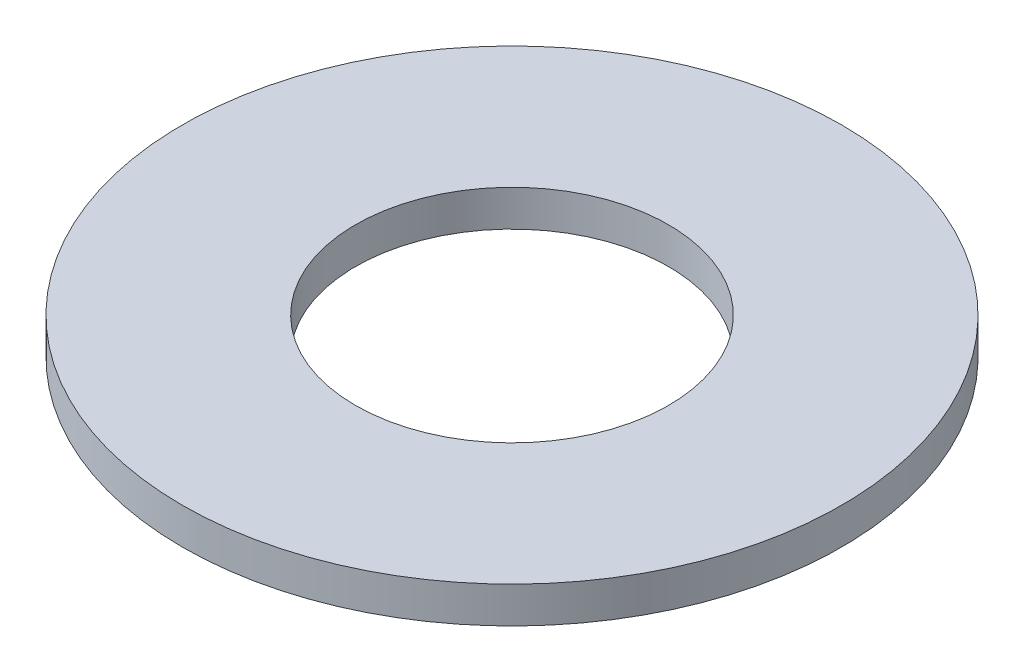
ISO-10303-21;
HEADER;
FILE_DESCRIPTION(('STEP AP214'),'2;1');
FILE_NAME('part.step','',(''),(''),'','','');
FILE_SCHEMA(('AUTOMOTIVE_DESIGN { 1 0 10303 214 1 1 1 1 }'));
ENDSEC;
DATA;
#1=APPLICATION_CONTEXT('core data for automotive mechanical design processes');
#2=APPLICATION_PROTOCOL_DEFINITION('international standard','automotive_design',2000,#1);
#3=PRODUCT_CONTEXT('',#1,'mechanical');
#4=PRODUCT('Part','Part','',(#3));
#5=PRODUCT_RELATED_PRODUCT_CATEGORY('part','',(#4));
#6=PRODUCT_DEFINITION_FORMATION('','',#4);
#7=PRODUCT_DEFINITION_CONTEXT('part definition',#1,'design');
#8=PRODUCT_DEFINITION('design','',#6,#7);
#9=PRODUCT_DEFINITION_SHAPE('','',#8);
#10=(LENGTH_UNIT() NAMED_UNIT(*) SI_UNIT(.MILLI.,.METRE.));
#11=(NAMED_UNIT(*) PLANE_ANGLE_UNIT() SI_UNIT($,.RADIAN.));
#12=(NAMED_UNIT(*) SI_UNIT($,.STERADIAN.) SOLID_ANGLE_UNIT());
#13=UNCERTAINTY_MEASURE_WITH_UNIT(LENGTH_MEASURE(1.E-05),#10,'distance_accuracy_value','');
#14=(GEOMETRIC_REPRESENTATION_CONTEXT(3) GLOBAL_UNCERTAINTY_ASSIGNED_CONTEXT((#13)) GLOBAL_UNIT_ASSIGNED_CONTEXT((#10,
#11,#12)) REPRESENTATION_CONTEXT('',''));
#15=CARTESIAN_POINT('',(0.,0.,0.));
#16=DIRECTION('',(0.,0.,1.));
#17=DIRECTION('',(1.,0.,0.));
#18=AXIS2_PLACEMENT_3D('',#15,#16,#17);
#19=CARTESIAN_POINT('',(0.,11.,0.));
#20=DIRECTION('',(0.,-1.,0.));
#21=DIRECTION('',(0.,0.,-1.));
#22=AXIS2_PLACEMENT_3D('',#19,#20,#21);
#23=CYLINDRICAL_SURFACE('',#22,100.);
#24=CARTESIAN_POINT('',(0.,11.,0.));
#25=DIRECTION('',(0.,1.,0.));
#26=DIRECTION('',(0.,0.,1.));
#27=AXIS2_PLACEMENT_3D('',#24,#25,#26);
#28=CIRCLE('',#27,100.);
#29=CARTESIAN_POINT('',(0.,11.,100.));
#30=VERTEX_POINT('',#29);
#31=EDGE_CURVE('E10',#30,#30,#28,.T.);
#32=ORIENTED_EDGE('',*,*,#31,.F.);
#33=EDGE_LOOP('',(#32));
#34=FACE_BOUND('',#33,.T.);
#35=CARTESIAN_POINT('',(0.,0.,0.));
#36=DIRECTION('',(0.,1.,0.));
#37=DIRECTION('',(0.,0.,1.));
#38=AXIS2_PLACEMENT_3D('',#35,#36,#37);
#39=CIRCLE('',#38,100.);
#40=CARTESIAN_POINT('',(0.,0.,100.));
#41=VERTEX_POINT('',#40);
#42=EDGE_CURVE('E37',#41,#41,#39,.T.);
#43=ORIENTED_EDGE('',*,*,#42,.T.);
#44=EDGE_LOOP('',(#43));
#45=FACE_BOUND('',#44,.T.);
#46=ADVANCED_FACE('F40',(#34,#45),#23,.T.);
#47=CARTESIAN_POINT('',(0.,11.,0.));
#48=DIRECTION('',(0.,1.,0.));
#49=DIRECTION('',(0.,0.,1.));
#50=AXIS2_PLACEMENT_3D('',#47,#48,#49);
#51=PLANE('',#50);
#52=CARTESIAN_POINT('',(0.,11.,0.));
#53=DIRECTION('',(0.,1.,0.));
#54=DIRECTION('',(0.,0.,1.));
#55=AXIS2_PLACEMENT_3D('',#52,#53,#54);
#56=CIRCLE('',#55,47.5);
#57=CARTESIAN_POINT('',(0.,11.,47.5));
#58=VERTEX_POINT('',#57);
#59=EDGE_CURVE('E50',#58,#58,#56,.T.);
#60=ORIENTED_EDGE('',*,*,#59,.F.);
#61=EDGE_LOOP('',(#60));
#62=FACE_BOUND('',#61,.T.);
#63=ORIENTED_EDGE('',*,*,#31,.T.);
#64=EDGE_LOOP('',(#63));
#65=FACE_BOUND('',#64,.T.);
#66=ADVANCED_FACE('F59',(#62,#65),#51,.T.);
#67=CARTESIAN_POINT('',(0.,0.,0.));
#68=DIRECTION('',(0.,1.,0.));
#69=DIRECTION('',(0.,0.,1.));
#70=AXIS2_PLACEMENT_3D('',#67,#68,#69);
#71=PLANE('',#70);
#72=CARTESIAN_POINT('',(0.,0.,0.));
#73=DIRECTION('',(0.,1.,0.));
#74=DIRECTION('',(0.,0.,1.));
#75=AXIS2_PLACEMENT_3D('',#72,#73,#74);
#76=CIRCLE('',#75,47.5);
#77=CARTESIAN_POINT('',(0.,0.,47.5));
#78=VERTEX_POINT('',#77);
#79=EDGE_CURVE('E47',#78,#78,#76,.T.);
#80=ORIENTED_EDGE('',*,*,#79,.T.);
#81=EDGE_LOOP('',(#80));
#82=FACE_BOUND('',#81,.T.);
#83=ORIENTED_EDGE('',*,*,#42,.F.);
#84=EDGE_LOOP('',(#83));
#85=FACE_BOUND('',#84,.T.);
#86=ADVANCED_FACE('F58',(#82,#85),#71,.F.);
#87=CARTESIAN_POINT('',(0.,11.,0.));
#88=DIRECTION('',(0.,-1.,0.));
#89=DIRECTION('',(0.,0.,-1.));
#90=AXIS2_PLACEMENT_3D('',#87,#88,#89);
#91=CYLINDRICAL_SURFACE('',#90,47.5);
#92=ORIENTED_EDGE('',*,*,#59,.T.);
#93=EDGE_LOOP('',(#92));
#94=FACE_BOUND('',#93,.T.);
#95=ORIENTED_EDGE('',*,*,#79,.F.);
#96=EDGE_LOOP('',(#95));
#97=FACE_BOUND('',#96,.T.);
#98=ADVANCED_FACE('F54',(#94,#97),#91,.F.);
#99=CLOSED_SHELL('',(#46,#66,#86,#98));
#100=MANIFOLD_SOLID_BREP('B2',#99);
#101=ADVANCED_BREP_SHAPE_REPRESENTATION('',(#18,#100),#14);
#102=SHAPE_DEFINITION_REPRESENTATION(#9,#101);
ENDSEC;
END-ISO-10303-21;
